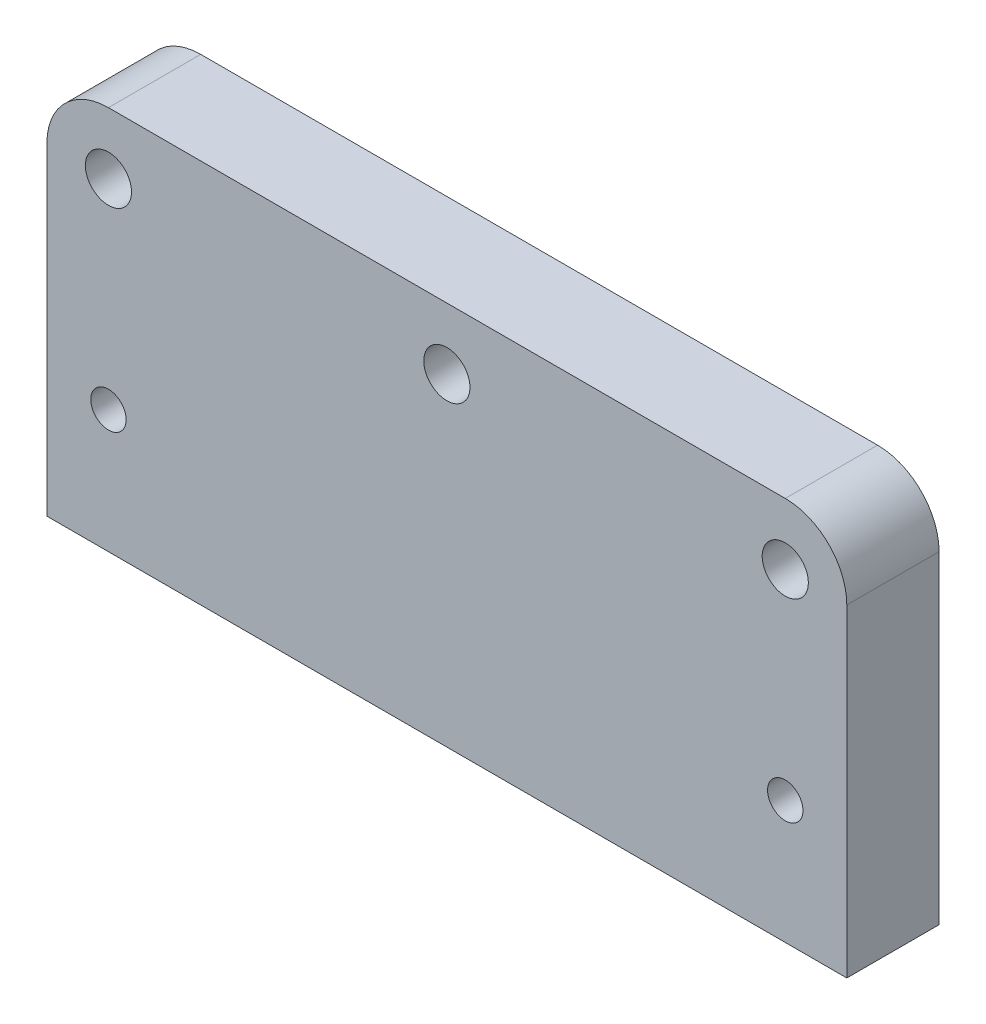
ISO-10303-21;
HEADER;
FILE_DESCRIPTION(('STEP AP214'),'2;1');
FILE_NAME('part.step','',(''),(''),'','','');
FILE_SCHEMA(('AUTOMOTIVE_DESIGN { 1 0 10303 214 1 1 1 1 }'));
ENDSEC;
DATA;
#1=APPLICATION_CONTEXT('core data for automotive mechanical design processes');
#2=APPLICATION_PROTOCOL_DEFINITION('international standard','automotive_design',2000,#1);
#3=PRODUCT_CONTEXT('',#1,'mechanical');
#4=PRODUCT('Part','Part','',(#3));
#5=PRODUCT_RELATED_PRODUCT_CATEGORY('part','',(#4));
#6=PRODUCT_DEFINITION_FORMATION('','',#4);
#7=PRODUCT_DEFINITION_CONTEXT('part definition',#1,'design');
#8=PRODUCT_DEFINITION('design','',#6,#7);
#9=PRODUCT_DEFINITION_SHAPE('','',#8);
#10=(LENGTH_UNIT() NAMED_UNIT(*) SI_UNIT(.MILLI.,.METRE.));
#11=(NAMED_UNIT(*) PLANE_ANGLE_UNIT() SI_UNIT($,.RADIAN.));
#12=(NAMED_UNIT(*) SI_UNIT($,.STERADIAN.) SOLID_ANGLE_UNIT());
#13=UNCERTAINTY_MEASURE_WITH_UNIT(LENGTH_MEASURE(1.E-05),#10,'distance_accuracy_value','');
#14=(GEOMETRIC_REPRESENTATION_CONTEXT(3) GLOBAL_UNCERTAINTY_ASSIGNED_CONTEXT((#13)) GLOBAL_UNIT_ASSIGNED_CONTEXT((#10,
#11,#12)) REPRESENTATION_CONTEXT('',''));
#15=CARTESIAN_POINT('',(0.,0.,0.));
#16=DIRECTION('',(0.,0.,1.));
#17=DIRECTION('',(1.,0.,0.));
#18=AXIS2_PLACEMENT_3D('',#15,#16,#17);
#19=CARTESIAN_POINT('',(4.,21.,6.));
#20=DIRECTION('',(0.,0.,1.));
#21=DIRECTION('',(1.,0.,0.));
#22=AXIS2_PLACEMENT_3D('',#19,#20,#21);
#23=PLANE('',#22);
#24=CARTESIAN_POINT('',(48.,8.,6.));
#25=DIRECTION('',(0.,0.,1.));
#26=DIRECTION('',(1.,0.,0.));
#27=AXIS2_PLACEMENT_3D('',#24,#25,#26);
#28=CIRCLE('',#27,1.15);
#29=CARTESIAN_POINT('',(49.15,8.,6.));
#30=VERTEX_POINT('',#29);
#31=EDGE_CURVE('E194',#30,#30,#28,.T.);
#32=ORIENTED_EDGE('',*,*,#31,.F.);
#33=EDGE_LOOP('',(#32));
#34=FACE_BOUND('',#33,.T.);
#35=CARTESIAN_POINT('',(48.,21.,6.));
#36=DIRECTION('',(0.,0.,1.));
#37=DIRECTION('',(1.,0.,0.));
#38=AXIS2_PLACEMENT_3D('',#35,#36,#37);
#39=CIRCLE('',#38,1.5);
#40=CARTESIAN_POINT('',(49.5,21.,6.));
#41=VERTEX_POINT('',#40);
#42=EDGE_CURVE('E206',#41,#41,#39,.T.);
#43=ORIENTED_EDGE('',*,*,#42,.F.);
#44=EDGE_LOOP('',(#43));
#45=FACE_BOUND('',#44,.T.);
#46=DIRECTION('',(0.,-1.,0.));
#47=VECTOR('',#46,1.);
#48=CARTESIAN_POINT('',(0.,0.,6.));
#49=LINE('',#48,#47);
#50=CARTESIAN_POINT('',(0.,21.,6.));
#51=VERTEX_POINT('',#50);
#52=CARTESIAN_POINT('',(0.,0.,6.));
#53=VERTEX_POINT('',#52);
#54=EDGE_CURVE('E129',#51,#53,#49,.T.);
#55=ORIENTED_EDGE('',*,*,#54,.T.);
#56=DIRECTION('',(1.,0.,0.));
#57=VECTOR('',#56,1.);
#58=CARTESIAN_POINT('',(0.,0.,6.));
#59=LINE('',#58,#57);
#60=CARTESIAN_POINT('',(52.,0.,6.));
#61=VERTEX_POINT('',#60);
#62=EDGE_CURVE('E87',#53,#61,#59,.T.);
#63=ORIENTED_EDGE('',*,*,#62,.T.);
#64=DIRECTION('',(0.,1.,0.));
#65=VECTOR('',#64,1.);
#66=CARTESIAN_POINT('',(52.,0.,6.));
#67=LINE('',#66,#65);
#68=CARTESIAN_POINT('',(52.,21.,6.));
#69=VERTEX_POINT('',#68);
#70=EDGE_CURVE('E100',#61,#69,#67,.T.);
#71=ORIENTED_EDGE('',*,*,#70,.T.);
#72=CARTESIAN_POINT('',(48.,21.,6.));
#73=DIRECTION('',(0.,0.,1.));
#74=DIRECTION('',(-1.,0.,0.));
#75=AXIS2_PLACEMENT_3D('',#72,#73,#74);
#76=CIRCLE('',#75,4.);
#77=CARTESIAN_POINT('',(48.,25.,6.));
#78=VERTEX_POINT('',#77);
#79=EDGE_CURVE('E94',#69,#78,#76,.T.);
#80=ORIENTED_EDGE('',*,*,#79,.T.);
#81=DIRECTION('',(-1.,0.,0.));
#82=VECTOR('',#81,1.);
#83=CARTESIAN_POINT('',(48.,25.,6.));
#84=LINE('',#83,#82);
#85=CARTESIAN_POINT('',(4.,25.,6.));
#86=VERTEX_POINT('',#85);
#87=EDGE_CURVE('E98',#78,#86,#84,.T.);
#88=ORIENTED_EDGE('',*,*,#87,.T.);
#89=CARTESIAN_POINT('',(4.,21.,6.));
#90=DIRECTION('',(0.,0.,1.));
#91=DIRECTION('',(1.,0.,0.));
#92=AXIS2_PLACEMENT_3D('',#89,#90,#91);
#93=CIRCLE('',#92,4.);
#94=EDGE_CURVE('E50',#86,#51,#93,.T.);
#95=ORIENTED_EDGE('',*,*,#94,.T.);
#96=EDGE_LOOP('',(#55,#63,#71,#80,#88,#95));
#97=FACE_BOUND('',#96,.T.);
#98=CARTESIAN_POINT('',(4.,21.,6.));
#99=DIRECTION('',(0.,0.,1.));
#100=DIRECTION('',(1.,0.,0.));
#101=AXIS2_PLACEMENT_3D('',#98,#99,#100);
#102=CIRCLE('',#101,1.5);
#103=CARTESIAN_POINT('',(5.5,21.,6.));
#104=VERTEX_POINT('',#103);
#105=EDGE_CURVE('E122',#104,#104,#102,.T.);
#106=ORIENTED_EDGE('',*,*,#105,.F.);
#107=EDGE_LOOP('',(#106));
#108=FACE_BOUND('',#107,.T.);
#109=CARTESIAN_POINT('',(4.,8.,6.));
#110=DIRECTION('',(0.,0.,1.));
#111=DIRECTION('',(1.,0.,0.));
#112=AXIS2_PLACEMENT_3D('',#109,#110,#111);
#113=CIRCLE('',#112,1.15);
#114=CARTESIAN_POINT('',(5.15,8.,6.));
#115=VERTEX_POINT('',#114);
#116=EDGE_CURVE('E200',#115,#115,#113,.T.);
#117=ORIENTED_EDGE('',*,*,#116,.F.);
#118=EDGE_LOOP('',(#117));
#119=FACE_BOUND('',#118,.T.);
#120=CARTESIAN_POINT('',(26.,21.,6.));
#121=DIRECTION('',(0.,0.,1.));
#122=DIRECTION('',(1.,0.,0.));
#123=AXIS2_PLACEMENT_3D('',#120,#121,#122);
#124=CIRCLE('',#123,1.5);
#125=CARTESIAN_POINT('',(27.5,21.,6.));
#126=VERTEX_POINT('',#125);
#127=EDGE_CURVE('E185',#126,#126,#124,.T.);
#128=ORIENTED_EDGE('',*,*,#127,.F.);
#129=EDGE_LOOP('',(#128));
#130=FACE_BOUND('',#129,.T.);
#131=ADVANCED_FACE('F33',(#34,#45,#97,#108,#119,#130),#23,.T.);
#132=CARTESIAN_POINT('',(4.,21.,0.));
#133=DIRECTION('',(0.,0.,1.));
#134=DIRECTION('',(1.,0.,0.));
#135=AXIS2_PLACEMENT_3D('',#132,#133,#134);
#136=PLANE('',#135);
#137=CARTESIAN_POINT('',(48.,8.,0.));
#138=DIRECTION('',(0.,0.,1.));
#139=DIRECTION('',(1.,0.,0.));
#140=AXIS2_PLACEMENT_3D('',#137,#138,#139);
#141=CIRCLE('',#140,1.15);
#142=CARTESIAN_POINT('',(49.15,8.,0.));
#143=VERTEX_POINT('',#142);
#144=EDGE_CURVE('E191',#143,#143,#141,.T.);
#145=ORIENTED_EDGE('',*,*,#144,.T.);
#146=EDGE_LOOP('',(#145));
#147=FACE_BOUND('',#146,.T.);
#148=CARTESIAN_POINT('',(48.,21.,0.));
#149=DIRECTION('',(0.,0.,1.));
#150=DIRECTION('',(1.,0.,0.));
#151=AXIS2_PLACEMENT_3D('',#148,#149,#150);
#152=CIRCLE('',#151,1.5);
#153=CARTESIAN_POINT('',(49.5,21.,0.));
#154=VERTEX_POINT('',#153);
#155=EDGE_CURVE('E203',#154,#154,#152,.T.);
#156=ORIENTED_EDGE('',*,*,#155,.T.);
#157=EDGE_LOOP('',(#156));
#158=FACE_BOUND('',#157,.T.);
#159=DIRECTION('',(0.,-1.,0.));
#160=VECTOR('',#159,1.);
#161=CARTESIAN_POINT('',(0.,0.,0.));
#162=LINE('',#161,#160);
#163=CARTESIAN_POINT('',(0.,21.,0.));
#164=VERTEX_POINT('',#163);
#165=CARTESIAN_POINT('',(0.,0.,0.));
#166=VERTEX_POINT('',#165);
#167=EDGE_CURVE('E118',#164,#166,#162,.T.);
#168=ORIENTED_EDGE('',*,*,#167,.F.);
#169=CARTESIAN_POINT('',(4.,21.,0.));
#170=DIRECTION('',(0.,0.,1.));
#171=DIRECTION('',(1.,0.,0.));
#172=AXIS2_PLACEMENT_3D('',#169,#170,#171);
#173=CIRCLE('',#172,4.);
#174=CARTESIAN_POINT('',(4.,25.,0.));
#175=VERTEX_POINT('',#174);
#176=EDGE_CURVE('E79',#175,#164,#173,.T.);
#177=ORIENTED_EDGE('',*,*,#176,.F.);
#178=DIRECTION('',(-1.,0.,0.));
#179=VECTOR('',#178,1.);
#180=CARTESIAN_POINT('',(48.,25.,0.));
#181=LINE('',#180,#179);
#182=CARTESIAN_POINT('',(48.,25.,0.));
#183=VERTEX_POINT('',#182);
#184=EDGE_CURVE('E73',#183,#175,#181,.T.);
#185=ORIENTED_EDGE('',*,*,#184,.F.);
#186=CARTESIAN_POINT('',(48.,21.,0.));
#187=DIRECTION('',(0.,0.,1.));
#188=DIRECTION('',(-1.,0.,0.));
#189=AXIS2_PLACEMENT_3D('',#186,#187,#188);
#190=CIRCLE('',#189,4.);
#191=CARTESIAN_POINT('',(52.,21.,0.));
#192=VERTEX_POINT('',#191);
#193=EDGE_CURVE('E108',#192,#183,#190,.T.);
#194=ORIENTED_EDGE('',*,*,#193,.F.);
#195=DIRECTION('',(0.,1.,0.));
#196=VECTOR('',#195,1.);
#197=CARTESIAN_POINT('',(52.,0.,0.));
#198=LINE('',#197,#196);
#199=CARTESIAN_POINT('',(52.,0.,0.));
#200=VERTEX_POINT('',#199);
#201=EDGE_CURVE('E124',#200,#192,#198,.T.);
#202=ORIENTED_EDGE('',*,*,#201,.F.);
#203=DIRECTION('',(1.,0.,0.));
#204=VECTOR('',#203,1.);
#205=CARTESIAN_POINT('',(0.,0.,0.));
#206=LINE('',#205,#204);
#207=EDGE_CURVE('E121',#166,#200,#206,.T.);
#208=ORIENTED_EDGE('',*,*,#207,.F.);
#209=EDGE_LOOP('',(#168,#177,#185,#194,#202,#208));
#210=FACE_BOUND('',#209,.T.);
#211=CARTESIAN_POINT('',(4.,21.,0.));
#212=DIRECTION('',(0.,0.,1.));
#213=DIRECTION('',(1.,0.,0.));
#214=AXIS2_PLACEMENT_3D('',#211,#212,#213);
#215=CIRCLE('',#214,1.5);
#216=CARTESIAN_POINT('',(5.5,21.,0.));
#217=VERTEX_POINT('',#216);
#218=EDGE_CURVE('E209',#217,#217,#215,.T.);
#219=ORIENTED_EDGE('',*,*,#218,.T.);
#220=EDGE_LOOP('',(#219));
#221=FACE_BOUND('',#220,.T.);
#222=CARTESIAN_POINT('',(4.,8.,0.));
#223=DIRECTION('',(0.,0.,1.));
#224=DIRECTION('',(1.,0.,0.));
#225=AXIS2_PLACEMENT_3D('',#222,#223,#224);
#226=CIRCLE('',#225,1.15);
#227=CARTESIAN_POINT('',(5.15,8.,0.));
#228=VERTEX_POINT('',#227);
#229=EDGE_CURVE('E197',#228,#228,#226,.T.);
#230=ORIENTED_EDGE('',*,*,#229,.T.);
#231=EDGE_LOOP('',(#230));
#232=FACE_BOUND('',#231,.T.);
#233=CARTESIAN_POINT('',(26.,21.,0.));
#234=DIRECTION('',(0.,0.,1.));
#235=DIRECTION('',(1.,0.,0.));
#236=AXIS2_PLACEMENT_3D('',#233,#234,#235);
#237=CIRCLE('',#236,1.5);
#238=CARTESIAN_POINT('',(27.5,21.,0.));
#239=VERTEX_POINT('',#238);
#240=EDGE_CURVE('E188',#239,#239,#237,.T.);
#241=ORIENTED_EDGE('',*,*,#240,.T.);
#242=EDGE_LOOP('',(#241));
#243=FACE_BOUND('',#242,.T.);
#244=ADVANCED_FACE('F138',(#147,#158,#210,#221,#232,#243),#136,.F.);
#245=CARTESIAN_POINT('',(0.,0.,6.));
#246=DIRECTION('',(1.,0.,0.));
#247=DIRECTION('',(0.,0.,-1.));
#248=AXIS2_PLACEMENT_3D('',#245,#246,#247);
#249=PLANE('',#248);
#250=ORIENTED_EDGE('',*,*,#167,.T.);
#251=DIRECTION('',(0.,0.,-1.));
#252=VECTOR('',#251,1.);
#253=CARTESIAN_POINT('',(0.,0.,6.));
#254=LINE('',#253,#252);
#255=EDGE_CURVE('E11',#53,#166,#254,.T.);
#256=ORIENTED_EDGE('',*,*,#255,.F.);
#257=ORIENTED_EDGE('',*,*,#54,.F.);
#258=DIRECTION('',(0.,0.,-1.));
#259=VECTOR('',#258,1.);
#260=CARTESIAN_POINT('',(0.,21.,6.));
#261=LINE('',#260,#259);
#262=EDGE_CURVE('E114',#51,#164,#261,.T.);
#263=ORIENTED_EDGE('',*,*,#262,.T.);
#264=EDGE_LOOP('',(#250,#256,#257,#263));
#265=FACE_BOUND('',#264,.T.);
#266=ADVANCED_FACE('F35',(#265),#249,.F.);
#267=CARTESIAN_POINT('',(0.,0.,6.));
#268=DIRECTION('',(0.,1.,0.));
#269=DIRECTION('',(0.,0.,1.));
#270=AXIS2_PLACEMENT_3D('',#267,#268,#269);
#271=PLANE('',#270);
#272=ORIENTED_EDGE('',*,*,#207,.T.);
#273=DIRECTION('',(0.,0.,-1.));
#274=VECTOR('',#273,1.);
#275=CARTESIAN_POINT('',(52.,0.,6.));
#276=LINE('',#275,#274);
#277=EDGE_CURVE('E42',#61,#200,#276,.T.);
#278=ORIENTED_EDGE('',*,*,#277,.F.);
#279=ORIENTED_EDGE('',*,*,#62,.F.);
#280=ORIENTED_EDGE('',*,*,#255,.T.);
#281=EDGE_LOOP('',(#272,#278,#279,#280));
#282=FACE_BOUND('',#281,.T.);
#283=ADVANCED_FACE('F275',(#282),#271,.F.);
#284=CARTESIAN_POINT('',(52.,0.,6.));
#285=DIRECTION('',(-1.,0.,0.));
#286=DIRECTION('',(0.,-1.,0.));
#287=AXIS2_PLACEMENT_3D('',#284,#285,#286);
#288=PLANE('',#287);
#289=ORIENTED_EDGE('',*,*,#201,.T.);
#290=DIRECTION('',(0.,0.,-1.));
#291=VECTOR('',#290,1.);
#292=CARTESIAN_POINT('',(52.,21.,6.));
#293=LINE('',#292,#291);
#294=EDGE_CURVE('E109',#69,#192,#293,.T.);
#295=ORIENTED_EDGE('',*,*,#294,.F.);
#296=ORIENTED_EDGE('',*,*,#70,.F.);
#297=ORIENTED_EDGE('',*,*,#277,.T.);
#298=EDGE_LOOP('',(#289,#295,#296,#297));
#299=FACE_BOUND('',#298,.T.);
#300=ADVANCED_FACE('F135',(#299),#288,.F.);
#301=CARTESIAN_POINT('',(48.,21.,6.));
#302=DIRECTION('',(0.,0.,-1.));
#303=DIRECTION('',(-1.,0.,0.));
#304=AXIS2_PLACEMENT_3D('',#301,#302,#303);
#305=CYLINDRICAL_SURFACE('',#304,4.);
#306=ORIENTED_EDGE('',*,*,#193,.T.);
#307=DIRECTION('',(0.,0.,-1.));
#308=VECTOR('',#307,1.);
#309=CARTESIAN_POINT('',(48.,25.,6.));
#310=LINE('',#309,#308);
#311=EDGE_CURVE('E105',#78,#183,#310,.T.);
#312=ORIENTED_EDGE('',*,*,#311,.F.);
#313=ORIENTED_EDGE('',*,*,#79,.F.);
#314=ORIENTED_EDGE('',*,*,#294,.T.);
#315=EDGE_LOOP('',(#306,#312,#313,#314));
#316=FACE_BOUND('',#315,.T.);
#317=ADVANCED_FACE('F106',(#316),#305,.T.);
#318=CARTESIAN_POINT('',(48.,25.,6.));
#319=DIRECTION('',(0.,-1.,0.));
#320=DIRECTION('',(0.,0.,-1.));
#321=AXIS2_PLACEMENT_3D('',#318,#319,#320);
#322=PLANE('',#321);
#323=ORIENTED_EDGE('',*,*,#184,.T.);
#324=DIRECTION('',(0.,0.,-1.));
#325=VECTOR('',#324,1.);
#326=CARTESIAN_POINT('',(4.,25.,6.));
#327=LINE('',#326,#325);
#328=EDGE_CURVE('E110',#86,#175,#327,.T.);
#329=ORIENTED_EDGE('',*,*,#328,.F.);
#330=ORIENTED_EDGE('',*,*,#87,.F.);
#331=ORIENTED_EDGE('',*,*,#311,.T.);
#332=EDGE_LOOP('',(#323,#329,#330,#331));
#333=FACE_BOUND('',#332,.T.);
#334=ADVANCED_FACE('F112',(#333),#322,.F.);
#335=CARTESIAN_POINT('',(4.,21.,6.));
#336=DIRECTION('',(0.,0.,-1.));
#337=DIRECTION('',(-1.,0.,0.));
#338=AXIS2_PLACEMENT_3D('',#335,#336,#337);
#339=CYLINDRICAL_SURFACE('',#338,4.);
#340=ORIENTED_EDGE('',*,*,#176,.T.);
#341=ORIENTED_EDGE('',*,*,#262,.F.);
#342=ORIENTED_EDGE('',*,*,#94,.F.);
#343=ORIENTED_EDGE('',*,*,#328,.T.);
#344=EDGE_LOOP('',(#340,#341,#342,#343));
#345=FACE_BOUND('',#344,.T.);
#346=ADVANCED_FACE('F143',(#345),#339,.T.);
#347=CARTESIAN_POINT('',(4.,21.,6.));
#348=DIRECTION('',(0.,0.,-1.));
#349=DIRECTION('',(-1.,0.,0.));
#350=AXIS2_PLACEMENT_3D('',#347,#348,#349);
#351=CYLINDRICAL_SURFACE('',#350,1.5);
#352=ORIENTED_EDGE('',*,*,#105,.T.);
#353=EDGE_LOOP('',(#352));
#354=FACE_BOUND('',#353,.T.);
#355=ORIENTED_EDGE('',*,*,#218,.F.);
#356=EDGE_LOOP('',(#355));
#357=FACE_BOUND('',#356,.T.);
#358=ADVANCED_FACE('F145',(#354,#357),#351,.F.);
#359=CARTESIAN_POINT('',(48.,21.,6.));
#360=DIRECTION('',(0.,0.,-1.));
#361=DIRECTION('',(-1.,0.,0.));
#362=AXIS2_PLACEMENT_3D('',#359,#360,#361);
#363=CYLINDRICAL_SURFACE('',#362,1.5);
#364=ORIENTED_EDGE('',*,*,#42,.T.);
#365=EDGE_LOOP('',(#364));
#366=FACE_BOUND('',#365,.T.);
#367=ORIENTED_EDGE('',*,*,#155,.F.);
#368=EDGE_LOOP('',(#367));
#369=FACE_BOUND('',#368,.T.);
#370=ADVANCED_FACE('F151',(#366,#369),#363,.F.);
#371=CARTESIAN_POINT('',(4.,8.,6.));
#372=DIRECTION('',(0.,0.,-1.));
#373=DIRECTION('',(-1.,0.,0.));
#374=AXIS2_PLACEMENT_3D('',#371,#372,#373);
#375=CYLINDRICAL_SURFACE('',#374,1.15);
#376=ORIENTED_EDGE('',*,*,#116,.T.);
#377=EDGE_LOOP('',(#376));
#378=FACE_BOUND('',#377,.T.);
#379=ORIENTED_EDGE('',*,*,#229,.F.);
#380=EDGE_LOOP('',(#379));
#381=FACE_BOUND('',#380,.T.);
#382=ADVANCED_FACE('F168',(#378,#381),#375,.F.);
#383=CARTESIAN_POINT('',(48.,8.,6.));
#384=DIRECTION('',(0.,0.,-1.));
#385=DIRECTION('',(-1.,0.,0.));
#386=AXIS2_PLACEMENT_3D('',#383,#384,#385);
#387=CYLINDRICAL_SURFACE('',#386,1.15);
#388=ORIENTED_EDGE('',*,*,#31,.T.);
#389=EDGE_LOOP('',(#388));
#390=FACE_BOUND('',#389,.T.);
#391=ORIENTED_EDGE('',*,*,#144,.F.);
#392=EDGE_LOOP('',(#391));
#393=FACE_BOUND('',#392,.T.);
#394=ADVANCED_FACE('F172',(#390,#393),#387,.F.);
#395=CARTESIAN_POINT('',(26.,21.,6.));
#396=DIRECTION('',(0.,0.,-1.));
#397=DIRECTION('',(-1.,0.,0.));
#398=AXIS2_PLACEMENT_3D('',#395,#396,#397);
#399=CYLINDRICAL_SURFACE('',#398,1.5);
#400=ORIENTED_EDGE('',*,*,#127,.T.);
#401=EDGE_LOOP('',(#400));
#402=FACE_BOUND('',#401,.T.);
#403=ORIENTED_EDGE('',*,*,#240,.F.);
#404=EDGE_LOOP('',(#403));
#405=FACE_BOUND('',#404,.T.);
#406=ADVANCED_FACE('F176',(#402,#405),#399,.F.);
#407=CLOSED_SHELL('',(#131,#244,#266,#283,#300,#317,#334,#346,#358,#370,#382,#394,#406));
#408=MANIFOLD_SOLID_BREP('B2',#407);
#409=ADVANCED_BREP_SHAPE_REPRESENTATION('',(#18,#408),#14);
#410=SHAPE_DEFINITION_REPRESENTATION(#9,#409);
ENDSEC;
END-ISO-10303-21;
